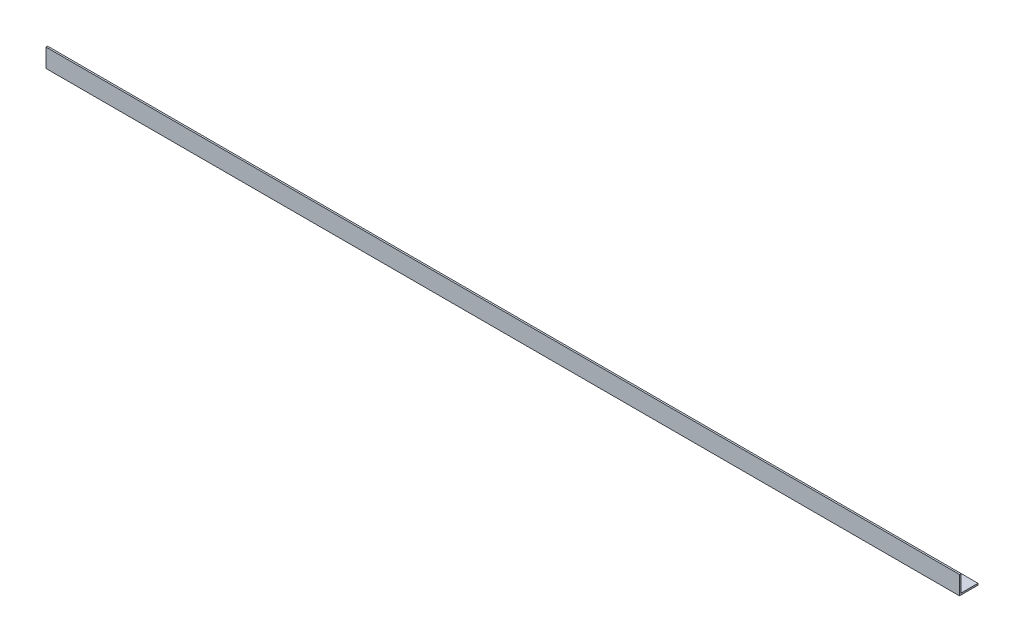
ISO-10303-21;
HEADER;
FILE_DESCRIPTION(('STEP AP214'),'2;1');
FILE_NAME('part.step','',(''),(''),'','','');
FILE_SCHEMA(('AUTOMOTIVE_DESIGN { 1 0 10303 214 1 1 1 1 }'));
ENDSEC;
DATA;
#1=APPLICATION_CONTEXT('core data for automotive mechanical design processes');
#2=APPLICATION_PROTOCOL_DEFINITION('international standard','automotive_design',2000,#1);
#3=PRODUCT_CONTEXT('',#1,'mechanical');
#4=PRODUCT('Part','Part','',(#3));
#5=PRODUCT_RELATED_PRODUCT_CATEGORY('part','',(#4));
#6=PRODUCT_DEFINITION_FORMATION('','',#4);
#7=PRODUCT_DEFINITION_CONTEXT('part definition',#1,'design');
#8=PRODUCT_DEFINITION('design','',#6,#7);
#9=PRODUCT_DEFINITION_SHAPE('','',#8);
#10=(LENGTH_UNIT() NAMED_UNIT(*) SI_UNIT(.MILLI.,.METRE.));
#11=(NAMED_UNIT(*) PLANE_ANGLE_UNIT() SI_UNIT($,.RADIAN.));
#12=(NAMED_UNIT(*) SI_UNIT($,.STERADIAN.) SOLID_ANGLE_UNIT());
#13=UNCERTAINTY_MEASURE_WITH_UNIT(LENGTH_MEASURE(1.E-05),#10,'distance_accuracy_value','');
#14=(GEOMETRIC_REPRESENTATION_CONTEXT(3) GLOBAL_UNCERTAINTY_ASSIGNED_CONTEXT((#13)) GLOBAL_UNIT_ASSIGNED_CONTEXT((#10,
#11,#12)) REPRESENTATION_CONTEXT('',''));
#15=CARTESIAN_POINT('',(0.,0.,0.));
#16=DIRECTION('',(0.,0.,1.));
#17=DIRECTION('',(1.,0.,0.));
#18=AXIS2_PLACEMENT_3D('',#15,#16,#17);
#19=CARTESIAN_POINT('',(1660.,0.,0.));
#20=DIRECTION('',(0.,1.,0.));
#21=DIRECTION('',(0.,0.,1.));
#22=AXIS2_PLACEMENT_3D('',#19,#20,#21);
#23=PLANE('',#22);
#24=DIRECTION('',(0.,0.,-1.));
#25=VECTOR('',#24,1.);
#26=CARTESIAN_POINT('',(0.,0.,0.));
#27=LINE('',#26,#25);
#28=CARTESIAN_POINT('',(0.,0.,0.));
#29=VERTEX_POINT('',#28);
#30=CARTESIAN_POINT('',(0.,0.,-33.7));
#31=VERTEX_POINT('',#30);
#32=EDGE_CURVE('E116',#29,#31,#27,.T.);
#33=ORIENTED_EDGE('',*,*,#32,.T.);
#34=DIRECTION('',(-1.,0.,0.));
#35=VECTOR('',#34,1.);
#36=CARTESIAN_POINT('',(1660.,0.,-33.7));
#37=LINE('',#36,#35);
#38=CARTESIAN_POINT('',(1660.,0.,-33.7));
#39=VERTEX_POINT('',#38);
#40=EDGE_CURVE('E11',#39,#31,#37,.T.);
#41=ORIENTED_EDGE('',*,*,#40,.F.);
#42=DIRECTION('',(0.,0.,-1.));
#43=VECTOR('',#42,1.);
#44=CARTESIAN_POINT('',(1660.,0.,0.));
#45=LINE('',#44,#43);
#46=CARTESIAN_POINT('',(1660.,0.,0.));
#47=VERTEX_POINT('',#46);
#48=EDGE_CURVE('E81',#47,#39,#45,.T.);
#49=ORIENTED_EDGE('',*,*,#48,.F.);
#50=DIRECTION('',(-1.,0.,0.));
#51=VECTOR('',#50,1.);
#52=CARTESIAN_POINT('',(1660.,0.,0.));
#53=LINE('',#52,#51);
#54=EDGE_CURVE('E112',#47,#29,#53,.T.);
#55=ORIENTED_EDGE('',*,*,#54,.T.);
#56=EDGE_LOOP('',(#33,#41,#49,#55));
#57=FACE_BOUND('',#56,.T.);
#58=ADVANCED_FACE('F35',(#57),#23,.F.);
#59=CARTESIAN_POINT('',(1660.,3.,-33.7));
#60=DIRECTION('',(0.,0.,-1.));
#61=DIRECTION('',(-1.,0.,0.));
#62=AXIS2_PLACEMENT_3D('',#59,#60,#61);
#63=PLANE('',#62);
#64=DIRECTION('',(0.,-1.,0.));
#65=VECTOR('',#64,1.);
#66=CARTESIAN_POINT('',(0.,3.,-33.7));
#67=LINE('',#66,#65);
#68=CARTESIAN_POINT('',(0.,3.,-33.7));
#69=VERTEX_POINT('',#68);
#70=EDGE_CURVE('E119',#69,#31,#67,.T.);
#71=ORIENTED_EDGE('',*,*,#70,.F.);
#72=DIRECTION('',(-1.,0.,0.));
#73=VECTOR('',#72,1.);
#74=CARTESIAN_POINT('',(1660.,3.,-33.7));
#75=LINE('',#74,#73);
#76=CARTESIAN_POINT('',(1660.,3.,-33.7));
#77=VERTEX_POINT('',#76);
#78=EDGE_CURVE('E43',#77,#69,#75,.T.);
#79=ORIENTED_EDGE('',*,*,#78,.F.);
#80=DIRECTION('',(0.,-1.,0.));
#81=VECTOR('',#80,1.);
#82=CARTESIAN_POINT('',(1660.,3.,-33.7));
#83=LINE('',#82,#81);
#84=EDGE_CURVE('E205',#77,#39,#83,.T.);
#85=ORIENTED_EDGE('',*,*,#84,.T.);
#86=ORIENTED_EDGE('',*,*,#40,.T.);
#87=EDGE_LOOP('',(#71,#79,#85,#86));
#88=FACE_BOUND('',#87,.T.);
#89=ADVANCED_FACE('F137',(#88),#63,.T.);
#90=CARTESIAN_POINT('',(1660.,3.,0.));
#91=DIRECTION('',(0.,1.,0.));
#92=DIRECTION('',(0.,0.,1.));
#93=AXIS2_PLACEMENT_3D('',#90,#91,#92);
#94=PLANE('',#93);
#95=DIRECTION('',(0.,0.,-1.));
#96=VECTOR('',#95,1.);
#97=CARTESIAN_POINT('',(0.,3.,0.));
#98=LINE('',#97,#96);
#99=CARTESIAN_POINT('',(0.,3.,-3.));
#100=VERTEX_POINT('',#99);
#101=EDGE_CURVE('E122',#100,#69,#98,.T.);
#102=ORIENTED_EDGE('',*,*,#101,.F.);
#103=DIRECTION('',(-1.,0.,0.));
#104=VECTOR('',#103,1.);
#105=CARTESIAN_POINT('',(1660.,3.,-3.));
#106=LINE('',#105,#104);
#107=CARTESIAN_POINT('',(1660.,3.,-3.));
#108=VERTEX_POINT('',#107);
#109=EDGE_CURVE('E102',#108,#100,#106,.T.);
#110=ORIENTED_EDGE('',*,*,#109,.F.);
#111=DIRECTION('',(0.,0.,-1.));
#112=VECTOR('',#111,1.);
#113=CARTESIAN_POINT('',(1660.,3.,0.));
#114=LINE('',#113,#112);
#115=EDGE_CURVE('E108',#108,#77,#114,.T.);
#116=ORIENTED_EDGE('',*,*,#115,.T.);
#117=ORIENTED_EDGE('',*,*,#78,.T.);
#118=EDGE_LOOP('',(#102,#110,#116,#117));
#119=FACE_BOUND('',#118,.T.);
#120=ADVANCED_FACE('F134',(#119),#94,.T.);
#121=CARTESIAN_POINT('',(1660.,33.7,-3.));
#122=DIRECTION('',(0.,0.,-1.));
#123=DIRECTION('',(0.,1.,0.));
#124=AXIS2_PLACEMENT_3D('',#121,#122,#123);
#125=PLANE('',#124);
#126=DIRECTION('',(0.,-1.,0.));
#127=VECTOR('',#126,1.);
#128=CARTESIAN_POINT('',(0.,33.7,-3.));
#129=LINE('',#128,#127);
#130=CARTESIAN_POINT('',(0.,33.7,-3.));
#131=VERTEX_POINT('',#130);
#132=EDGE_CURVE('E97',#131,#100,#129,.T.);
#133=ORIENTED_EDGE('',*,*,#132,.F.);
#134=DIRECTION('',(-1.,0.,0.));
#135=VECTOR('',#134,1.);
#136=CARTESIAN_POINT('',(1660.,33.7,-3.));
#137=LINE('',#136,#135);
#138=CARTESIAN_POINT('',(1660.,33.7,-3.));
#139=VERTEX_POINT('',#138);
#140=EDGE_CURVE('E92',#139,#131,#137,.T.);
#141=ORIENTED_EDGE('',*,*,#140,.F.);
#142=DIRECTION('',(0.,-1.,0.));
#143=VECTOR('',#142,1.);
#144=CARTESIAN_POINT('',(1660.,33.7,-3.));
#145=LINE('',#144,#143);
#146=EDGE_CURVE('E95',#139,#108,#145,.T.);
#147=ORIENTED_EDGE('',*,*,#146,.T.);
#148=ORIENTED_EDGE('',*,*,#109,.T.);
#149=EDGE_LOOP('',(#133,#141,#147,#148));
#150=FACE_BOUND('',#149,.T.);
#151=ADVANCED_FACE('F94',(#150),#125,.T.);
#152=CARTESIAN_POINT('',(1660.,33.7,0.));
#153=DIRECTION('',(0.,1.,0.));
#154=DIRECTION('',(0.,0.,1.));
#155=AXIS2_PLACEMENT_3D('',#152,#153,#154);
#156=PLANE('',#155);
#157=DIRECTION('',(0.,0.,-1.));
#158=VECTOR('',#157,1.);
#159=CARTESIAN_POINT('',(0.,33.7,0.));
#160=LINE('',#159,#158);
#161=CARTESIAN_POINT('',(0.,33.7,0.));
#162=VERTEX_POINT('',#161);
#163=EDGE_CURVE('E126',#162,#131,#160,.T.);
#164=ORIENTED_EDGE('',*,*,#163,.F.);
#165=DIRECTION('',(-1.,0.,0.));
#166=VECTOR('',#165,1.);
#167=CARTESIAN_POINT('',(1660.,33.7,0.));
#168=LINE('',#167,#166);
#169=CARTESIAN_POINT('',(1660.,33.7,0.));
#170=VERTEX_POINT('',#169);
#171=EDGE_CURVE('E72',#170,#162,#168,.T.);
#172=ORIENTED_EDGE('',*,*,#171,.F.);
#173=DIRECTION('',(0.,0.,-1.));
#174=VECTOR('',#173,1.);
#175=CARTESIAN_POINT('',(1660.,33.7,0.));
#176=LINE('',#175,#174);
#177=EDGE_CURVE('E106',#170,#139,#176,.T.);
#178=ORIENTED_EDGE('',*,*,#177,.T.);
#179=ORIENTED_EDGE('',*,*,#140,.T.);
#180=EDGE_LOOP('',(#164,#172,#178,#179));
#181=FACE_BOUND('',#180,.T.);
#182=ADVANCED_FACE('F110',(#181),#156,.T.);
#183=CARTESIAN_POINT('',(1660.,33.7,0.));
#184=DIRECTION('',(0.,0.,-1.));
#185=DIRECTION('',(0.,1.,0.));
#186=AXIS2_PLACEMENT_3D('',#183,#184,#185);
#187=PLANE('',#186);
#188=DIRECTION('',(0.,-1.,0.));
#189=VECTOR('',#188,1.);
#190=CARTESIAN_POINT('',(0.,33.7,0.));
#191=LINE('',#190,#189);
#192=EDGE_CURVE('E75',#162,#29,#191,.T.);
#193=ORIENTED_EDGE('',*,*,#192,.T.);
#194=ORIENTED_EDGE('',*,*,#54,.F.);
#195=DIRECTION('',(0.,-1.,0.));
#196=VECTOR('',#195,1.);
#197=CARTESIAN_POINT('',(1660.,33.7,0.));
#198=LINE('',#197,#196);
#199=EDGE_CURVE('E51',#170,#47,#198,.T.);
#200=ORIENTED_EDGE('',*,*,#199,.F.);
#201=ORIENTED_EDGE('',*,*,#171,.T.);
#202=EDGE_LOOP('',(#193,#194,#200,#201));
#203=FACE_BOUND('',#202,.T.);
#204=ADVANCED_FACE('F142',(#203),#187,.F.);
#205=CARTESIAN_POINT('',(1660.,0.,0.));
#206=DIRECTION('',(-1.,0.,0.));
#207=DIRECTION('',(0.,0.,1.));
#208=AXIS2_PLACEMENT_3D('',#205,#206,#207);
#209=PLANE('',#208);
#210=ORIENTED_EDGE('',*,*,#48,.T.);
#211=ORIENTED_EDGE('',*,*,#84,.F.);
#212=ORIENTED_EDGE('',*,*,#115,.F.);
#213=ORIENTED_EDGE('',*,*,#146,.F.);
#214=ORIENTED_EDGE('',*,*,#177,.F.);
#215=ORIENTED_EDGE('',*,*,#199,.T.);
#216=EDGE_LOOP('',(#210,#211,#212,#213,#214,#215));
#217=FACE_BOUND('',#216,.T.);
#218=ADVANCED_FACE('F105',(#217),#209,.F.);
#219=CARTESIAN_POINT('',(0.,0.,0.));
#220=DIRECTION('',(-1.,0.,0.));
#221=DIRECTION('',(0.,0.,1.));
#222=AXIS2_PLACEMENT_3D('',#219,#220,#221);
#223=PLANE('',#222);
#224=ORIENTED_EDGE('',*,*,#32,.F.);
#225=ORIENTED_EDGE('',*,*,#192,.F.);
#226=ORIENTED_EDGE('',*,*,#163,.T.);
#227=ORIENTED_EDGE('',*,*,#132,.T.);
#228=ORIENTED_EDGE('',*,*,#101,.T.);
#229=ORIENTED_EDGE('',*,*,#70,.T.);
#230=EDGE_LOOP('',(#224,#225,#226,#227,#228,#229));
#231=FACE_BOUND('',#230,.T.);
#232=ADVANCED_FACE('F140',(#231),#223,.T.);
#233=CLOSED_SHELL('',(#58,#89,#120,#151,#182,#204,#218,#232));
#234=MANIFOLD_SOLID_BREP('B2',#233);
#235=ADVANCED_BREP_SHAPE_REPRESENTATION('',(#18,#234),#14);
#236=SHAPE_DEFINITION_REPRESENTATION(#9,#235);
ENDSEC;
END-ISO-10303-21;
